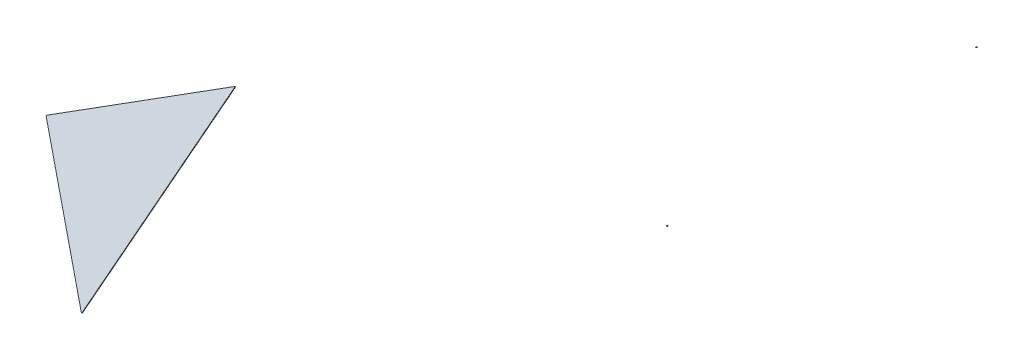
ISO-10303-21;
HEADER;
FILE_DESCRIPTION(('STEP AP214'),'2;1');
FILE_NAME('part.step','',(''),(''),'','','');
FILE_SCHEMA(('AUTOMOTIVE_DESIGN { 1 0 10303 214 1 1 1 1 }'));
ENDSEC;
DATA;
#1=APPLICATION_CONTEXT('core data for automotive mechanical design processes');
#2=APPLICATION_PROTOCOL_DEFINITION('international standard','automotive_design',2000,#1);
#3=PRODUCT_CONTEXT('',#1,'mechanical');
#4=PRODUCT('Part','Part','',(#3));
#5=PRODUCT_RELATED_PRODUCT_CATEGORY('part','',(#4));
#6=PRODUCT_DEFINITION_FORMATION('','',#4);
#7=PRODUCT_DEFINITION_CONTEXT('part definition',#1,'design');
#8=PRODUCT_DEFINITION('design','',#6,#7);
#9=PRODUCT_DEFINITION_SHAPE('','',#8);
#10=(LENGTH_UNIT() NAMED_UNIT(*) SI_UNIT(.MILLI.,.METRE.));
#11=(NAMED_UNIT(*) PLANE_ANGLE_UNIT() SI_UNIT($,.RADIAN.));
#12=(NAMED_UNIT(*) SI_UNIT($,.STERADIAN.) SOLID_ANGLE_UNIT());
#13=UNCERTAINTY_MEASURE_WITH_UNIT(LENGTH_MEASURE(1.E-05),#10,'distance_accuracy_value','');
#14=(GEOMETRIC_REPRESENTATION_CONTEXT(3) GLOBAL_UNCERTAINTY_ASSIGNED_CONTEXT((#13)) GLOBAL_UNIT_ASSIGNED_CONTEXT((#10,
#11,#12)) REPRESENTATION_CONTEXT('',''));
#15=CARTESIAN_POINT('',(0.,0.,0.));
#16=DIRECTION('',(0.,0.,1.));
#17=DIRECTION('',(1.,0.,0.));
#18=AXIS2_PLACEMENT_3D('',#15,#16,#17);
#19=CARTESIAN_POINT('',(1158.95080176923,2608.91710603682,1121.2545563695));
#20=DIRECTION('',(0.,-1.,0.));
#21=DIRECTION('',(0.,0.,-1.));
#22=AXIS2_PLACEMENT_3D('',#19,#20,#21);
#23=PLANE('',#22);
#24=DIRECTION('',(-1.,0.,0.));
#25=VECTOR('',#24,1.);
#26=CARTESIAN_POINT('',(1158.95080176923,2608.91710603682,1121.2545563695));
#27=LINE('',#26,#25);
#28=CARTESIAN_POINT('',(1158.95080176923,2608.91710603682,1121.2545563695));
#29=VERTEX_POINT('',#28);
#30=CARTESIAN_POINT('',(1155.77580176923,2608.91710603682,1121.2545563695));
#31=VERTEX_POINT('',#30);
#32=EDGE_CURVE('E77',#29,#31,#27,.T.);
#33=ORIENTED_EDGE('',*,*,#32,.T.);
#34=DIRECTION('',(0.,0.,1.));
#35=VECTOR('',#34,1.);
#36=CARTESIAN_POINT('',(1155.77580176923,2608.91710603682,1121.2545563695));
#37=LINE('',#36,#35);
#38=CARTESIAN_POINT('',(1155.77580176923,2608.91710603682,1123.8342438695));
#39=VERTEX_POINT('',#38);
#40=EDGE_CURVE('E71',#31,#39,#37,.T.);
#41=ORIENTED_EDGE('',*,*,#40,.T.);
#42=DIRECTION('',(-0.776114000116266,0.,0.630592625094465));
#43=VECTOR('',#42,1.);
#44=CARTESIAN_POINT('',(1158.95080176923,2608.91710603682,1121.2545563695));
#45=LINE('',#44,#43);
#46=EDGE_CURVE('E76',#29,#39,#45,.T.);
#47=ORIENTED_EDGE('',*,*,#46,.F.);
#48=EDGE_LOOP('',(#33,#41,#47));
#49=FACE_BOUND('',#48,.T.);
#50=ADVANCED_FACE('F48',(#49),#23,.F.);
#51=CARTESIAN_POINT('',(-316.337763001159,500.225965029596,-389.338785232194));
#52=DIRECTION('',(-0.446530337817959,0.70609992000595,-0.54957580039133));
#53=DIRECTION('',(0.,0.614210049001455,0.789142582620929));
#54=AXIS2_PLACEMENT_3D('',#51,#52,#53);
#55=PLANE('',#54);
#56=ORIENTED_EDGE('',*,*,#46,.T.);
#57=DIRECTION('',(0.,-0.614210049001455,-0.789142582620929));
#58=VECTOR('',#57,1.);
#59=CARTESIAN_POINT('',(1155.77580176923,1079.97105689285,-840.569360192474));
#60=LINE('',#59,#58);
#61=CARTESIAN_POINT('',(1155.77580176923,2606.90926864383,1121.2545563695));
#62=VERTEX_POINT('',#61);
#63=EDGE_CURVE('E64',#39,#62,#60,.T.);
#64=ORIENTED_EDGE('',*,*,#63,.T.);
#65=DIRECTION('',(0.84517937784663,0.53448275862069,0.));
#66=VECTOR('',#65,1.);
#67=CARTESIAN_POINT('',(-86.1674576744258,1821.51710603682,1121.2545563695));
#68=LINE('',#67,#66);
#69=EDGE_CURVE('E58',#62,#29,#68,.T.);
#70=ORIENTED_EDGE('',*,*,#69,.T.);
#71=EDGE_LOOP('',(#56,#64,#70));
#72=FACE_BOUND('',#71,.T.);
#73=ADVANCED_FACE('F94',(#72),#55,.F.);
#74=CARTESIAN_POINT('',(-86.1674576744258,1821.51710603682,1121.2545563695));
#75=DIRECTION('',(0.,0.,1.));
#76=DIRECTION('',(0.,-1.,0.));
#77=AXIS2_PLACEMENT_3D('',#74,#75,#76);
#78=PLANE('',#77);
#79=ORIENTED_EDGE('',*,*,#69,.F.);
#80=DIRECTION('',(0.,1.,0.));
#81=VECTOR('',#80,1.);
#82=CARTESIAN_POINT('',(1155.77580176923,1821.51710603682,1121.2545563695));
#83=LINE('',#82,#81);
#84=EDGE_CURVE('E13',#62,#31,#83,.T.);
#85=ORIENTED_EDGE('',*,*,#84,.T.);
#86=ORIENTED_EDGE('',*,*,#32,.F.);
#87=EDGE_LOOP('',(#79,#85,#86));
#88=FACE_BOUND('',#87,.T.);
#89=ADVANCED_FACE('F82',(#88),#78,.F.);
#90=CARTESIAN_POINT('',(1155.77580176923,0.,0.));
#91=DIRECTION('',(1.,0.,0.));
#92=DIRECTION('',(0.,0.,-1.));
#93=AXIS2_PLACEMENT_3D('',#90,#91,#92);
#94=PLANE('',#93);
#95=ORIENTED_EDGE('',*,*,#40,.F.);
#96=ORIENTED_EDGE('',*,*,#84,.F.);
#97=ORIENTED_EDGE('',*,*,#63,.F.);
#98=EDGE_LOOP('',(#95,#96,#97));
#99=FACE_BOUND('',#98,.T.);
#100=ADVANCED_FACE('F50',(#99),#94,.F.);
#101=CLOSED_SHELL('',(#50,#73,#89,#100));
#102=MANIFOLD_SOLID_BREP('B2',#101);
#103=CARTESIAN_POINT('',(-86.1674576744258,1821.51710603682,1781.65455636951));
#104=DIRECTION('',(0.,0.,1.));
#105=DIRECTION('',(0.,-1.,0.));
#106=AXIS2_PLACEMENT_3D('',#103,#104,#105);
#107=PLANE('',#106);
#108=DIRECTION('',(0.,1.,0.));
#109=VECTOR('',#108,1.);
#110=CARTESIAN_POINT('',(1155.77580176923,1821.51710603682,1781.65455636951));
#111=LINE('',#110,#109);
#112=CARTESIAN_POINT('',(1155.77580176923,2606.90926864383,1781.6545563695));
#113=VERTEX_POINT('',#112);
#114=CARTESIAN_POINT('',(1155.77580176923,2608.91710603682,1781.6545563695));
#115=VERTEX_POINT('',#114);
#116=EDGE_CURVE('E46',#113,#115,#111,.T.);
#117=ORIENTED_EDGE('',*,*,#116,.F.);
#118=DIRECTION('',(0.84517937784663,0.53448275862069,0.));
#119=VECTOR('',#118,1.);
#120=CARTESIAN_POINT('',(-86.1674576744258,1821.51710603682,1781.65455636951));
#121=LINE('',#120,#119);
#122=CARTESIAN_POINT('',(1158.95080176923,2608.91710603682,1781.6545563695));
#123=VERTEX_POINT('',#122);
#124=EDGE_CURVE('E173',#113,#123,#121,.T.);
#125=ORIENTED_EDGE('',*,*,#124,.T.);
#126=DIRECTION('',(-1.,0.,0.));
#127=VECTOR('',#126,1.);
#128=CARTESIAN_POINT('',(1158.95080176923,2608.91710603682,1781.6545563695));
#129=LINE('',#128,#127);
#130=EDGE_CURVE('E170',#123,#115,#129,.T.);
#131=ORIENTED_EDGE('',*,*,#130,.T.);
#132=EDGE_LOOP('',(#117,#125,#131));
#133=FACE_BOUND('',#132,.T.);
#134=ADVANCED_FACE('F142',(#133),#107,.T.);
#135=CARTESIAN_POINT('',(-1028.71824250003,1626.71560523187,1266.11476000002));
#136=DIRECTION('',(-0.446530337817959,0.706099920005952,0.549575800391326));
#137=DIRECTION('',(0.,-0.614210049001451,0.789142582620932));
#138=AXIS2_PLACEMENT_3D('',#135,#136,#137);
#139=PLANE('',#138);
#140=ORIENTED_EDGE('',*,*,#124,.F.);
#141=DIRECTION('',(0.,0.614210049001451,-0.789142582620932));
#142=VECTOR('',#141,1.);
#143=CARTESIAN_POINT('',(1155.77580176923,2487.00908440184,1935.70338901769));
#144=LINE('',#143,#142);
#145=CARTESIAN_POINT('',(1155.77580176923,2608.91710603682,1779.07486886951));
#146=VERTEX_POINT('',#145);
#147=EDGE_CURVE('E146',#113,#146,#144,.T.);
#148=ORIENTED_EDGE('',*,*,#147,.T.);
#149=DIRECTION('',(-0.776114000116266,0.,-0.630592625094465));
#150=VECTOR('',#149,1.);
#151=CARTESIAN_POINT('',(1158.95080176923,2608.91710603682,1781.6545563695));
#152=LINE('',#151,#150);
#153=EDGE_CURVE('E169',#123,#146,#152,.T.);
#154=ORIENTED_EDGE('',*,*,#153,.F.);
#155=EDGE_LOOP('',(#140,#148,#154));
#156=FACE_BOUND('',#155,.T.);
#157=ADVANCED_FACE('F175',(#156),#139,.F.);
#158=CARTESIAN_POINT('',(1158.95080176923,2608.91710603682,1121.2545563695));
#159=DIRECTION('',(0.,-1.,0.));
#160=DIRECTION('',(0.,0.,-1.));
#161=AXIS2_PLACEMENT_3D('',#158,#159,#160);
#162=PLANE('',#161);
#163=ORIENTED_EDGE('',*,*,#153,.T.);
#164=DIRECTION('',(0.,0.,1.));
#165=VECTOR('',#164,1.);
#166=CARTESIAN_POINT('',(1155.77580176923,2608.91710603682,1121.2545563695));
#167=LINE('',#166,#165);
#168=EDGE_CURVE('E152',#146,#115,#167,.T.);
#169=ORIENTED_EDGE('',*,*,#168,.T.);
#170=ORIENTED_EDGE('',*,*,#130,.F.);
#171=EDGE_LOOP('',(#163,#169,#170));
#172=FACE_BOUND('',#171,.T.);
#173=ADVANCED_FACE('F189',(#172),#162,.F.);
#174=CARTESIAN_POINT('',(1155.77580176923,0.,0.));
#175=DIRECTION('',(1.,0.,0.));
#176=DIRECTION('',(0.,0.,-1.));
#177=AXIS2_PLACEMENT_3D('',#174,#175,#176);
#178=PLANE('',#177);
#179=ORIENTED_EDGE('',*,*,#147,.F.);
#180=ORIENTED_EDGE('',*,*,#116,.T.);
#181=ORIENTED_EDGE('',*,*,#168,.F.);
#182=EDGE_LOOP('',(#179,#180,#181));
#183=FACE_BOUND('',#182,.T.);
#184=ADVANCED_FACE('F144',(#183),#178,.F.);
#185=CLOSED_SHELL('',(#134,#157,#173,#184));
#186=MANIFOLD_SOLID_BREP('B7',#185);
#187=CARTESIAN_POINT('',(-1028.71824250003,1626.71560523187,1266.11476000002));
#188=DIRECTION('',(-0.446530337817959,0.706099920005952,0.549575800391326));
#189=DIRECTION('',(0.,-0.614210049001451,0.789142582620932));
#190=AXIS2_PLACEMENT_3D('',#187,#188,#189);
#191=PLANE('',#190);
#192=DIRECTION('',(-0.845179377846631,-0.534482758620689,0.));
#193=VECTOR('',#192,1.);
#194=CARTESIAN_POINT('',(-963.550844902216,1523.66618096281,1451.46209557153));
#195=LINE('',#194,#193);
#196=CARTESIAN_POINT('',(-92.6341982307692,2074.42492406847,1451.46209557153));
#197=VERTEX_POINT('',#196);
#198=CARTESIAN_POINT('',(-492.558178656548,1821.51710603682,1451.46209557153));
#199=VERTEX_POINT('',#198);
#200=EDGE_CURVE('E264',#197,#199,#195,.T.);
#201=ORIENTED_EDGE('',*,*,#200,.F.);
#202=DIRECTION('',(0.,0.614210049001451,-0.789142582620932));
#203=VECTOR('',#202,1.);
#204=CARTESIAN_POINT('',(-92.6341982307692,1995.36252434457,1553.04217620968));
#205=LINE('',#204,#203);
#206=CARTESIAN_POINT('',(-92.634198230768,1821.51710603682,1776.40032966748));
#207=VERTEX_POINT('',#206);
#208=EDGE_CURVE('E237',#207,#197,#205,.T.);
#209=ORIENTED_EDGE('',*,*,#208,.F.);
#210=DIRECTION('',(0.776114000116265,0.,0.630592625094466));
#211=VECTOR('',#210,1.);
#212=CARTESIAN_POINT('',(-86.1674576744258,1821.51710603682,1781.65455636951));
#213=LINE('',#212,#211);
#214=EDGE_CURVE('E231',#199,#207,#213,.T.);
#215=ORIENTED_EDGE('',*,*,#214,.F.);
#216=EDGE_LOOP('',(#201,#209,#215));
#217=FACE_BOUND('',#216,.T.);
#218=ADVANCED_FACE('F227',(#217),#191,.F.);
#219=CARTESIAN_POINT('',(-1031.89324250003,1626.71560523187,1266.11476000002));
#220=DIRECTION('',(-0.446530337817959,0.706099920005952,0.549575800391326));
#221=DIRECTION('',(0.,-0.614210049001451,0.789142582620932));
#222=AXIS2_PLACEMENT_3D('',#219,#220,#221);
#223=PLANE('',#222);
#224=DIRECTION('',(0.,0.614210049001451,-0.789142582620932));
#225=VECTOR('',#224,1.);
#226=CARTESIAN_POINT('',(-92.6341982307691,1996.61289708124,1554.01537359729));
#227=LINE('',#226,#225);
#228=CARTESIAN_POINT('',(-92.6341982307692,1821.51710603682,1778.98001716748));
#229=VERTEX_POINT('',#228);
#230=CARTESIAN_POINT('',(-92.6341982307692,2076.43276146145,1451.46209557153));
#231=VERTEX_POINT('',#230);
#232=EDGE_CURVE('E279',#229,#231,#227,.T.);
#233=ORIENTED_EDGE('',*,*,#232,.T.);
#234=DIRECTION('',(-0.845179377846631,-0.534482758620689,0.));
#235=VECTOR('',#234,1.);
#236=CARTESIAN_POINT('',(-966.725844902216,1523.66618096281,1451.46209557153));
#237=LINE('',#236,#235);
#238=CARTESIAN_POINT('',(-495.733178656548,1821.51710603682,1451.46209557153));
#239=VERTEX_POINT('',#238);
#240=EDGE_CURVE('E245',#231,#239,#237,.T.);
#241=ORIENTED_EDGE('',*,*,#240,.T.);
#242=DIRECTION('',(0.776114000116265,0.,0.630592625094466));
#243=VECTOR('',#242,1.);
#244=CARTESIAN_POINT('',(-89.3424576744258,1821.51710603682,1781.65455636951));
#245=LINE('',#244,#243);
#246=EDGE_CURVE('E276',#239,#229,#245,.T.);
#247=ORIENTED_EDGE('',*,*,#246,.T.);
#248=EDGE_LOOP('',(#233,#241,#247));
#249=FACE_BOUND('',#248,.T.);
#250=ADVANCED_FACE('F287',(#249),#223,.T.);
#251=CARTESIAN_POINT('',(-86.1674576744258,1821.51710603682,1121.2545563695));
#252=DIRECTION('',(0.,1.,0.));
#253=DIRECTION('',(0.,0.,1.));
#254=AXIS2_PLACEMENT_3D('',#251,#252,#253);
#255=PLANE('',#254);
#256=DIRECTION('',(-1.,0.,0.));
#257=VECTOR('',#256,1.);
#258=CARTESIAN_POINT('',(-86.1674576744258,1821.51710603682,1451.46209557153));
#259=LINE('',#258,#257);
#260=EDGE_CURVE('E271',#199,#239,#259,.T.);
#261=ORIENTED_EDGE('',*,*,#260,.F.);
#262=ORIENTED_EDGE('',*,*,#214,.T.);
#263=DIRECTION('',(0.,0.,-1.));
#264=VECTOR('',#263,1.);
#265=CARTESIAN_POINT('',(-92.6341982307692,1821.51710603682,1121.2545563695));
#266=LINE('',#265,#264);
#267=EDGE_CURVE('E274',#229,#207,#266,.T.);
#268=ORIENTED_EDGE('',*,*,#267,.F.);
#269=ORIENTED_EDGE('',*,*,#246,.F.);
#270=EDGE_LOOP('',(#261,#262,#268,#269));
#271=FACE_BOUND('',#270,.T.);
#272=ADVANCED_FACE('F229',(#271),#255,.F.);
#273=CARTESIAN_POINT('',(-92.6341982307692,0.,0.));
#274=DIRECTION('',(1.,0.,0.));
#275=DIRECTION('',(0.,0.,-1.));
#276=AXIS2_PLACEMENT_3D('',#273,#274,#275);
#277=PLANE('',#276);
#278=ORIENTED_EDGE('',*,*,#208,.T.);
#279=DIRECTION('',(0.,1.,0.));
#280=VECTOR('',#279,1.);
#281=CARTESIAN_POINT('',(-92.6341982307692,0.,1451.46209557153));
#282=LINE('',#281,#280);
#283=EDGE_CURVE('E140',#197,#231,#282,.T.);
#284=ORIENTED_EDGE('',*,*,#283,.T.);
#285=ORIENTED_EDGE('',*,*,#232,.F.);
#286=ORIENTED_EDGE('',*,*,#267,.T.);
#287=EDGE_LOOP('',(#278,#284,#285,#286));
#288=FACE_BOUND('',#287,.T.);
#289=ADVANCED_FACE('F273',(#288),#277,.T.);
#290=CARTESIAN_POINT('',(0.,0.,1451.46209557153));
#291=DIRECTION('',(0.,0.,-1.));
#292=DIRECTION('',(-1.,0.,0.));
#293=AXIS2_PLACEMENT_3D('',#290,#291,#292);
#294=PLANE('',#293);
#295=ORIENTED_EDGE('',*,*,#260,.T.);
#296=ORIENTED_EDGE('',*,*,#240,.F.);
#297=ORIENTED_EDGE('',*,*,#283,.F.);
#298=ORIENTED_EDGE('',*,*,#200,.T.);
#299=EDGE_LOOP('',(#295,#296,#297,#298));
#300=FACE_BOUND('',#299,.T.);
#301=ADVANCED_FACE('F263',(#300),#294,.T.);
#302=CLOSED_SHELL('',(#218,#250,#272,#289,#301));
#303=MANIFOLD_SOLID_BREP('B40',#302);
#304=ADVANCED_BREP_SHAPE_REPRESENTATION('',(#18,#102,#186,#303),#14);
#305=SHAPE_DEFINITION_REPRESENTATION(#9,#304);
ENDSEC;
END-ISO-10303-21;
